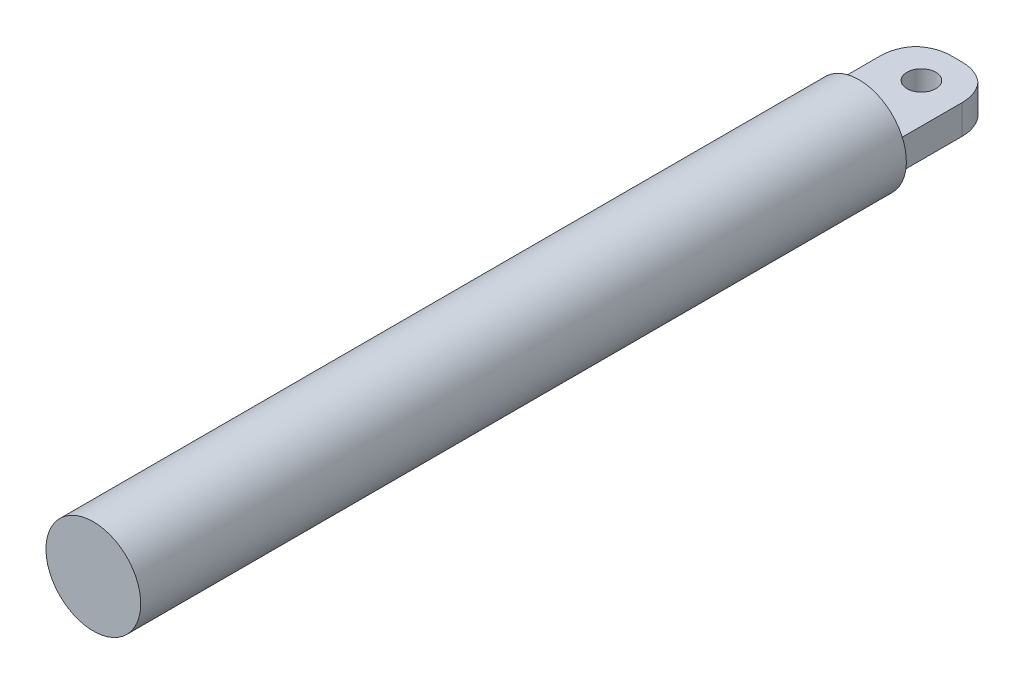
ISO-10303-21;
HEADER;
FILE_DESCRIPTION(('STEP AP214'),'2;1');
FILE_NAME('part.step','',(''),(''),'','','');
FILE_SCHEMA(('AUTOMOTIVE_DESIGN { 1 0 10303 214 1 1 1 1 }'));
ENDSEC;
DATA;
#1=APPLICATION_CONTEXT('core data for automotive mechanical design processes');
#2=APPLICATION_PROTOCOL_DEFINITION('international standard','automotive_design',2000,#1);
#3=PRODUCT_CONTEXT('',#1,'mechanical');
#4=PRODUCT('Part','Part','',(#3));
#5=PRODUCT_RELATED_PRODUCT_CATEGORY('part','',(#4));
#6=PRODUCT_DEFINITION_FORMATION('','',#4);
#7=PRODUCT_DEFINITION_CONTEXT('part definition',#1,'design');
#8=PRODUCT_DEFINITION('design','',#6,#7);
#9=PRODUCT_DEFINITION_SHAPE('','',#8);
#10=(LENGTH_UNIT() NAMED_UNIT(*) SI_UNIT(.MILLI.,.METRE.));
#11=(NAMED_UNIT(*) PLANE_ANGLE_UNIT() SI_UNIT($,.RADIAN.));
#12=(NAMED_UNIT(*) SI_UNIT($,.STERADIAN.) SOLID_ANGLE_UNIT());
#13=UNCERTAINTY_MEASURE_WITH_UNIT(LENGTH_MEASURE(1.E-05),#10,'distance_accuracy_value','');
#14=(GEOMETRIC_REPRESENTATION_CONTEXT(3) GLOBAL_UNCERTAINTY_ASSIGNED_CONTEXT((#13)) GLOBAL_UNIT_ASSIGNED_CONTEXT((#10,
#11,#12)) REPRESENTATION_CONTEXT('',''));
#15=CARTESIAN_POINT('',(0.,0.,0.));
#16=DIRECTION('',(0.,0.,1.));
#17=DIRECTION('',(1.,0.,0.));
#18=AXIS2_PLACEMENT_3D('',#15,#16,#17);
#19=CARTESIAN_POINT('',(-0.111192844127526,-2.71905444652675,760.069910861368));
#20=DIRECTION('',(0.,0.,1.));
#21=DIRECTION('',(0.,-1.,0.));
#22=AXIS2_PLACEMENT_3D('',#19,#20,#21);
#23=PLANE('',#22);
#24=CARTESIAN_POINT('',(-0.111192844127526,-2.71905444652675,760.069910861368));
#25=DIRECTION('',(0.,0.,-1.));
#26=DIRECTION('',(0.,1.,0.));
#27=AXIS2_PLACEMENT_3D('',#24,#25,#26);
#28=CIRCLE('',#27,90.7335);
#29=CARTESIAN_POINT('',(-0.111192844127526,88.0144455534732,760.069910861368));
#30=VERTEX_POINT('',#29);
#31=EDGE_CURVE('E144',#30,#30,#28,.T.);
#32=ORIENTED_EDGE('',*,*,#31,.F.);
#33=EDGE_LOOP('',(#32));
#34=FACE_BOUND('',#33,.T.);
#35=ADVANCED_FACE('F40',(#34),#23,.T.);
#36=CARTESIAN_POINT('',(-0.111192844127526,-2.71905444652658,-706.330089138632));
#37=DIRECTION('',(0.,0.,-1.));
#38=DIRECTION('',(0.,1.,0.));
#39=AXIS2_PLACEMENT_3D('',#36,#37,#38);
#40=PLANE('',#39);
#41=DIRECTION('',(0.,-1.,0.));
#42=VECTOR('',#41,1.);
#43=CARTESIAN_POINT('',(81.401830968793,-2.71905444652658,-706.330089138632));
#44=LINE('',#43,#42);
#45=CARTESIAN_POINT('',(81.401830968793,32.729832945527,-706.330089138632));
#46=VERTEX_POINT('',#45);
#47=CARTESIAN_POINT('',(81.401830968793,-23.3268138108288,-706.330089138632));
#48=VERTEX_POINT('',#47);
#49=EDGE_CURVE('E113',#46,#48,#44,.T.);
#50=ORIENTED_EDGE('',*,*,#49,.F.);
#51=DIRECTION('',(1.,0.,0.));
#52=VECTOR('',#51,1.);
#53=CARTESIAN_POINT('',(-0.111192844127526,32.729832945527,-706.330089138632));
#54=LINE('',#53,#52);
#55=CARTESIAN_POINT('',(-74.4330263147913,32.729832945527,-706.330089138632));
#56=VERTEX_POINT('',#55);
#57=EDGE_CURVE('E127',#56,#46,#54,.T.);
#58=ORIENTED_EDGE('',*,*,#57,.F.);
#59=DIRECTION('',(0.,1.,0.));
#60=VECTOR('',#59,1.);
#61=CARTESIAN_POINT('',(-74.4330263147913,-2.71905444652658,-706.330089138632));
#62=LINE('',#61,#60);
#63=CARTESIAN_POINT('',(-74.4330263147913,-23.3268138108288,-706.330089138632));
#64=VERTEX_POINT('',#63);
#65=EDGE_CURVE('E137',#64,#56,#62,.T.);
#66=ORIENTED_EDGE('',*,*,#65,.F.);
#67=DIRECTION('',(-1.,0.,0.));
#68=VECTOR('',#67,1.);
#69=CARTESIAN_POINT('',(-0.111192844127526,-23.3268138108288,-706.330089138632));
#70=LINE('',#69,#68);
#71=EDGE_CURVE('E130',#48,#64,#70,.T.);
#72=ORIENTED_EDGE('',*,*,#71,.F.);
#73=EDGE_LOOP('',(#50,#58,#66,#72));
#74=FACE_BOUND('',#73,.T.);
#75=CARTESIAN_POINT('',(-0.111192844127526,-2.71905444652658,-706.330089138632));
#76=DIRECTION('',(0.,0.,-1.));
#77=DIRECTION('',(0.,1.,0.));
#78=AXIS2_PLACEMENT_3D('',#75,#76,#77);
#79=CIRCLE('',#78,90.7335);
#80=CARTESIAN_POINT('',(-0.111192844127526,88.0144455534734,-706.330089138632));
#81=VERTEX_POINT('',#80);
#82=EDGE_CURVE('E138',#81,#81,#79,.T.);
#83=ORIENTED_EDGE('',*,*,#82,.T.);
#84=EDGE_LOOP('',(#83));
#85=FACE_BOUND('',#84,.T.);
#86=ADVANCED_FACE('F124',(#74,#85),#40,.T.);
#87=CARTESIAN_POINT('',(-0.111192844127526,-2.71905444652658,-706.330089138632));
#88=DIRECTION('',(0.,0.,-1.));
#89=DIRECTION('',(0.,1.,0.));
#90=AXIS2_PLACEMENT_3D('',#87,#88,#89);
#91=CYLINDRICAL_SURFACE('',#90,90.7335);
#92=ORIENTED_EDGE('',*,*,#31,.T.);
#93=EDGE_LOOP('',(#92));
#94=FACE_BOUND('',#93,.T.);
#95=ORIENTED_EDGE('',*,*,#82,.F.);
#96=EDGE_LOOP('',(#95));
#97=FACE_BOUND('',#96,.T.);
#98=ADVANCED_FACE('F216',(#94,#97),#91,.T.);
#99=CARTESIAN_POINT('',(81.401830968793,32.729832945527,-889.630089138632));
#100=DIRECTION('',(1.,0.,0.));
#101=DIRECTION('',(0.,0.,-1.));
#102=AXIS2_PLACEMENT_3D('',#99,#100,#101);
#103=PLANE('',#102);
#104=DIRECTION('',(0.,0.,1.));
#105=VECTOR('',#104,1.);
#106=CARTESIAN_POINT('',(81.401830968793,-23.3268138108288,-889.630089138632));
#107=LINE('',#106,#105);
#108=CARTESIAN_POINT('',(81.401830968793,-23.3268138108288,-822.599950745437));
#109=VERTEX_POINT('',#108);
#110=EDGE_CURVE('E205',#109,#48,#107,.T.);
#111=ORIENTED_EDGE('',*,*,#110,.F.);
#112=DIRECTION('',(0.,-1.,0.));
#113=VECTOR('',#112,1.);
#114=CARTESIAN_POINT('',(81.401830968793,32.729832945527,-822.599950745437));
#115=LINE('',#114,#113);
#116=CARTESIAN_POINT('',(81.401830968793,32.729832945527,-822.599950745437));
#117=VERTEX_POINT('',#116);
#118=EDGE_CURVE('E50',#109,#117,#115,.F.);
#119=ORIENTED_EDGE('',*,*,#118,.T.);
#120=DIRECTION('',(0.,0.,1.));
#121=VECTOR('',#120,1.);
#122=CARTESIAN_POINT('',(81.401830968793,32.729832945527,-889.630089138632));
#123=LINE('',#122,#121);
#124=EDGE_CURVE('E109',#117,#46,#123,.T.);
#125=ORIENTED_EDGE('',*,*,#124,.T.);
#126=ORIENTED_EDGE('',*,*,#49,.T.);
#127=EDGE_LOOP('',(#111,#119,#125,#126));
#128=FACE_BOUND('',#127,.T.);
#129=ADVANCED_FACE('F112',(#128),#103,.T.);
#130=CARTESIAN_POINT('',(81.401830968793,-23.3268138108288,-889.630089138632));
#131=DIRECTION('',(0.,-1.,0.));
#132=DIRECTION('',(0.,0.,-1.));
#133=AXIS2_PLACEMENT_3D('',#130,#131,#132);
#134=PLANE('',#133);
#135=CARTESIAN_POINT('',(5.68910131256064,-23.3268138108288,-820.086722731454));
#136=DIRECTION('',(0.,-1.,0.));
#137=DIRECTION('',(0.,0.,-1.));
#138=AXIS2_PLACEMENT_3D('',#135,#136,#137);
#139=CIRCLE('',#138,27.495);
#140=CARTESIAN_POINT('',(5.68910131256064,-23.3268138108288,-847.581722731454));
#141=VERTEX_POINT('',#140);
#142=EDGE_CURVE('E190',#141,#141,#139,.T.);
#143=ORIENTED_EDGE('',*,*,#142,.F.);
#144=EDGE_LOOP('',(#143));
#145=FACE_BOUND('',#144,.T.);
#146=CARTESIAN_POINT('',(14.3716925755976,-23.3268138108288,-816.310089138632));
#147=DIRECTION('',(0.,-1.,0.));
#148=DIRECTION('',(0.,0.,-1.));
#149=AXIS2_PLACEMENT_3D('',#146,#147,#148);
#150=CIRCLE('',#149,73.32);
#151=CARTESIAN_POINT('',(14.3716925755976,-23.3268138108288,-889.630089138632));
#152=VERTEX_POINT('',#151);
#153=CARTESIAN_POINT('',(62.9763570386491,-23.3268138108288,-871.204615208489));
#154=VERTEX_POINT('',#153);
#155=EDGE_CURVE('E58',#152,#154,#150,.T.);
#156=ORIENTED_EDGE('',*,*,#155,.T.);
#157=CARTESIAN_POINT('',(8.08183096879297,-23.3268138108288,-822.599950745437));
#158=DIRECTION('',(0.,-1.,0.));
#159=DIRECTION('',(0.,0.,-1.));
#160=AXIS2_PLACEMENT_3D('',#157,#158,#159);
#161=CIRCLE('',#160,73.32);
#162=EDGE_CURVE('E175',#154,#109,#161,.T.);
#163=ORIENTED_EDGE('',*,*,#162,.T.);
#164=ORIENTED_EDGE('',*,*,#110,.T.);
#165=ORIENTED_EDGE('',*,*,#71,.T.);
#166=DIRECTION('',(0.,0.,1.));
#167=VECTOR('',#166,1.);
#168=CARTESIAN_POINT('',(-74.4330263147913,-23.3268138108288,-889.630089138632));
#169=LINE('',#168,#167);
#170=CARTESIAN_POINT('',(-74.4330263147913,-23.3268138108288,-822.599950745437));
#171=VERTEX_POINT('',#170);
#172=EDGE_CURVE('E208',#171,#64,#169,.T.);
#173=ORIENTED_EDGE('',*,*,#172,.F.);
#174=CARTESIAN_POINT('',(-1.11302631479126,-23.3268138108288,-822.599950745437));
#175=DIRECTION('',(0.,-1.,0.));
#176=DIRECTION('',(0.,0.,-1.));
#177=AXIS2_PLACEMENT_3D('',#174,#175,#176);
#178=CIRCLE('',#177,73.32);
#179=CARTESIAN_POINT('',(-56.0075523846473,-23.3268138108288,-871.204615208489));
#180=VERTEX_POINT('',#179);
#181=EDGE_CURVE('E65',#171,#180,#178,.T.);
#182=ORIENTED_EDGE('',*,*,#181,.T.);
#183=CARTESIAN_POINT('',(-7.40288792159584,-23.3268138108288,-816.310089138632));
#184=DIRECTION('',(0.,-1.,0.));
#185=DIRECTION('',(0.,0.,-1.));
#186=AXIS2_PLACEMENT_3D('',#183,#184,#185);
#187=CIRCLE('',#186,73.32);
#188=CARTESIAN_POINT('',(-7.40288792159584,-23.3268138108288,-889.630089138632));
#189=VERTEX_POINT('',#188);
#190=EDGE_CURVE('E170',#180,#189,#187,.T.);
#191=ORIENTED_EDGE('',*,*,#190,.T.);
#192=DIRECTION('',(1.,0.,0.));
#193=VECTOR('',#192,1.);
#194=CARTESIAN_POINT('',(81.401830968793,-23.3268138108288,-889.630089138632));
#195=LINE('',#194,#193);
#196=EDGE_CURVE('E119',#189,#152,#195,.T.);
#197=ORIENTED_EDGE('',*,*,#196,.T.);
#198=EDGE_LOOP('',(#156,#163,#164,#165,#173,#182,#191,#197));
#199=FACE_BOUND('',#198,.T.);
#200=ADVANCED_FACE('F243',(#145,#199),#134,.T.);
#201=CARTESIAN_POINT('',(-74.4330263147913,32.729832945527,-889.630089138632));
#202=DIRECTION('',(-1.,0.,0.));
#203=DIRECTION('',(0.,0.,1.));
#204=AXIS2_PLACEMENT_3D('',#201,#202,#203);
#205=PLANE('',#204);
#206=DIRECTION('',(0.,0.,1.));
#207=VECTOR('',#206,1.);
#208=CARTESIAN_POINT('',(-74.4330263147913,32.729832945527,-889.630089138632));
#209=LINE('',#208,#207);
#210=CARTESIAN_POINT('',(-74.4330263147913,32.729832945527,-822.599950745437));
#211=VERTEX_POINT('',#210);
#212=EDGE_CURVE('E118',#211,#56,#209,.T.);
#213=ORIENTED_EDGE('',*,*,#212,.F.);
#214=DIRECTION('',(0.,1.,0.));
#215=VECTOR('',#214,1.);
#216=CARTESIAN_POINT('',(-74.4330263147913,32.729832945527,-822.599950745437));
#217=LINE('',#216,#215);
#218=EDGE_CURVE('E11',#211,#171,#217,.F.);
#219=ORIENTED_EDGE('',*,*,#218,.T.);
#220=ORIENTED_EDGE('',*,*,#172,.T.);
#221=ORIENTED_EDGE('',*,*,#65,.T.);
#222=EDGE_LOOP('',(#213,#219,#220,#221));
#223=FACE_BOUND('',#222,.T.);
#224=ADVANCED_FACE('F253',(#223),#205,.T.);
#225=CARTESIAN_POINT('',(81.401830968793,32.729832945527,-889.630089138632));
#226=DIRECTION('',(0.,1.,0.));
#227=DIRECTION('',(0.,0.,1.));
#228=AXIS2_PLACEMENT_3D('',#225,#226,#227);
#229=PLANE('',#228);
#230=CARTESIAN_POINT('',(5.68910131256064,32.729832945527,-820.086722731454));
#231=DIRECTION('',(0.,1.,0.));
#232=DIRECTION('',(0.,0.,1.));
#233=AXIS2_PLACEMENT_3D('',#230,#231,#232);
#234=CIRCLE('',#233,27.495);
#235=CARTESIAN_POINT('',(5.68910131256064,32.729832945527,-792.591722731454));
#236=VERTEX_POINT('',#235);
#237=EDGE_CURVE('E195',#236,#236,#234,.T.);
#238=ORIENTED_EDGE('',*,*,#237,.F.);
#239=EDGE_LOOP('',(#238));
#240=FACE_BOUND('',#239,.T.);
#241=ORIENTED_EDGE('',*,*,#124,.F.);
#242=CARTESIAN_POINT('',(8.08183096879297,32.729832945527,-822.599950745437));
#243=DIRECTION('',(0.,1.,0.));
#244=DIRECTION('',(0.,0.,1.));
#245=AXIS2_PLACEMENT_3D('',#242,#243,#244);
#246=CIRCLE('',#245,73.32);
#247=CARTESIAN_POINT('',(62.9763570386491,32.729832945527,-871.204615208489));
#248=VERTEX_POINT('',#247);
#249=EDGE_CURVE('E165',#117,#248,#246,.T.);
#250=ORIENTED_EDGE('',*,*,#249,.T.);
#251=CARTESIAN_POINT('',(14.3716925755976,32.729832945527,-816.310089138632));
#252=DIRECTION('',(0.,1.,0.));
#253=DIRECTION('',(0.,0.,1.));
#254=AXIS2_PLACEMENT_3D('',#251,#252,#253);
#255=CIRCLE('',#254,73.32);
#256=CARTESIAN_POINT('',(14.3716925755976,32.729832945527,-889.630089138632));
#257=VERTEX_POINT('',#256);
#258=EDGE_CURVE('E162',#248,#257,#255,.T.);
#259=ORIENTED_EDGE('',*,*,#258,.T.);
#260=DIRECTION('',(-1.,0.,0.));
#261=VECTOR('',#260,1.);
#262=CARTESIAN_POINT('',(81.401830968793,32.729832945527,-889.630089138632));
#263=LINE('',#262,#261);
#264=CARTESIAN_POINT('',(-7.40288792159584,32.729832945527,-889.630089138632));
#265=VERTEX_POINT('',#264);
#266=EDGE_CURVE('E182',#257,#265,#263,.T.);
#267=ORIENTED_EDGE('',*,*,#266,.T.);
#268=CARTESIAN_POINT('',(-7.40288792159584,32.729832945527,-816.310089138632));
#269=DIRECTION('',(0.,1.,0.));
#270=DIRECTION('',(0.,0.,1.));
#271=AXIS2_PLACEMENT_3D('',#268,#269,#270);
#272=CIRCLE('',#271,73.32);
#273=CARTESIAN_POINT('',(-56.0075523846473,32.729832945527,-871.204615208489));
#274=VERTEX_POINT('',#273);
#275=EDGE_CURVE('E159',#265,#274,#272,.T.);
#276=ORIENTED_EDGE('',*,*,#275,.T.);
#277=CARTESIAN_POINT('',(-1.11302631479126,32.729832945527,-822.599950745437));
#278=DIRECTION('',(0.,1.,0.));
#279=DIRECTION('',(0.,0.,1.));
#280=AXIS2_PLACEMENT_3D('',#277,#278,#279);
#281=CIRCLE('',#280,73.32);
#282=EDGE_CURVE('E156',#274,#211,#281,.T.);
#283=ORIENTED_EDGE('',*,*,#282,.T.);
#284=ORIENTED_EDGE('',*,*,#212,.T.);
#285=ORIENTED_EDGE('',*,*,#57,.T.);
#286=EDGE_LOOP('',(#241,#250,#259,#267,#276,#283,#284,#285));
#287=FACE_BOUND('',#286,.T.);
#288=ADVANCED_FACE('F134',(#240,#287),#229,.T.);
#289=CARTESIAN_POINT('',(-0.111192844127526,42.6476955534733,-889.630089138632));
#290=DIRECTION('',(0.,0.,-1.));
#291=DIRECTION('',(-1.,0.,0.));
#292=AXIS2_PLACEMENT_3D('',#289,#290,#291);
#293=PLANE('',#292);
#294=ORIENTED_EDGE('',*,*,#196,.F.);
#295=DIRECTION('',(0.,-1.,0.));
#296=VECTOR('',#295,1.);
#297=CARTESIAN_POINT('',(-7.40288792159584,42.6476955534733,-889.630089138632));
#298=LINE('',#297,#296);
#299=EDGE_CURVE('E152',#189,#265,#298,.F.);
#300=ORIENTED_EDGE('',*,*,#299,.T.);
#301=ORIENTED_EDGE('',*,*,#266,.F.);
#302=DIRECTION('',(0.,1.,0.));
#303=VECTOR('',#302,1.);
#304=CARTESIAN_POINT('',(14.3716925755976,42.6476955534733,-889.630089138632));
#305=LINE('',#304,#303);
#306=EDGE_CURVE('E132',#257,#152,#305,.F.);
#307=ORIENTED_EDGE('',*,*,#306,.T.);
#308=EDGE_LOOP('',(#294,#300,#301,#307));
#309=FACE_BOUND('',#308,.T.);
#310=ADVANCED_FACE('F232',(#309),#293,.T.);
#311=CARTESIAN_POINT('',(-1.11302631479126,32.729832945527,-822.599950745437));
#312=DIRECTION('',(0.,1.,0.));
#313=DIRECTION('',(0.,0.,1.));
#314=AXIS2_PLACEMENT_3D('',#311,#312,#313);
#315=CYLINDRICAL_SURFACE('',#314,73.32);
#316=DIRECTION('',(0.,1.,0.));
#317=VECTOR('',#316,1.);
#318=CARTESIAN_POINT('',(-56.0075523846473,4.70150956734906,-871.204615208489));
#319=LINE('',#318,#317);
#320=EDGE_CURVE('E179',#180,#274,#319,.T.);
#321=ORIENTED_EDGE('',*,*,#320,.F.);
#322=ORIENTED_EDGE('',*,*,#181,.F.);
#323=ORIENTED_EDGE('',*,*,#218,.F.);
#324=ORIENTED_EDGE('',*,*,#282,.F.);
#325=EDGE_LOOP('',(#321,#322,#323,#324));
#326=FACE_BOUND('',#325,.T.);
#327=ADVANCED_FACE('F230',(#326),#315,.T.);
#328=CARTESIAN_POINT('',(-7.40288792159584,42.6476955534733,-816.310089138632));
#329=DIRECTION('',(0.,-1.,0.));
#330=DIRECTION('',(0.,0.,-1.));
#331=AXIS2_PLACEMENT_3D('',#328,#329,#330);
#332=CYLINDRICAL_SURFACE('',#331,73.32);
#333=ORIENTED_EDGE('',*,*,#190,.F.);
#334=ORIENTED_EDGE('',*,*,#320,.T.);
#335=ORIENTED_EDGE('',*,*,#275,.F.);
#336=ORIENTED_EDGE('',*,*,#299,.F.);
#337=EDGE_LOOP('',(#333,#334,#335,#336));
#338=FACE_BOUND('',#337,.T.);
#339=ADVANCED_FACE('F227',(#338),#332,.T.);
#340=CARTESIAN_POINT('',(14.3716925755976,42.6476955534733,-816.310089138632));
#341=DIRECTION('',(0.,1.,0.));
#342=DIRECTION('',(0.,0.,1.));
#343=AXIS2_PLACEMENT_3D('',#340,#341,#342);
#344=CYLINDRICAL_SURFACE('',#343,73.32);
#345=DIRECTION('',(0.,1.,0.));
#346=VECTOR('',#345,1.);
#347=CARTESIAN_POINT('',(62.976357038649,4.70150956734906,-871.204615208489));
#348=LINE('',#347,#346);
#349=EDGE_CURVE('E44',#154,#248,#348,.T.);
#350=ORIENTED_EDGE('',*,*,#349,.F.);
#351=ORIENTED_EDGE('',*,*,#155,.F.);
#352=ORIENTED_EDGE('',*,*,#306,.F.);
#353=ORIENTED_EDGE('',*,*,#258,.F.);
#354=EDGE_LOOP('',(#350,#351,#352,#353));
#355=FACE_BOUND('',#354,.T.);
#356=ADVANCED_FACE('F42',(#355),#344,.T.);
#357=CARTESIAN_POINT('',(8.08183096879297,32.729832945527,-822.599950745437));
#358=DIRECTION('',(0.,-1.,0.));
#359=DIRECTION('',(0.,0.,-1.));
#360=AXIS2_PLACEMENT_3D('',#357,#358,#359);
#361=CYLINDRICAL_SURFACE('',#360,73.32);
#362=ORIENTED_EDGE('',*,*,#162,.F.);
#363=ORIENTED_EDGE('',*,*,#349,.T.);
#364=ORIENTED_EDGE('',*,*,#249,.F.);
#365=ORIENTED_EDGE('',*,*,#118,.F.);
#366=EDGE_LOOP('',(#362,#363,#364,#365));
#367=FACE_BOUND('',#366,.T.);
#368=ADVANCED_FACE('F234',(#367),#361,.T.);
#369=CARTESIAN_POINT('',(5.68910131256064,-40.5901670544731,-820.086722731454));
#370=DIRECTION('',(0.,1.,0.));
#371=DIRECTION('',(0.,0.,1.));
#372=AXIS2_PLACEMENT_3D('',#369,#370,#371);
#373=CYLINDRICAL_SURFACE('',#372,27.495);
#374=ORIENTED_EDGE('',*,*,#142,.T.);
#375=EDGE_LOOP('',(#374));
#376=FACE_BOUND('',#375,.T.);
#377=ORIENTED_EDGE('',*,*,#237,.T.);
#378=EDGE_LOOP('',(#377));
#379=FACE_BOUND('',#378,.T.);
#380=ADVANCED_FACE('F236',(#376,#379),#373,.F.);
#381=CLOSED_SHELL('',(#35,#86,#98,#129,#200,#224,#288,#310,#327,#339,#356,#368,#380));
#382=MANIFOLD_SOLID_BREP('B2',#381);
#383=ADVANCED_BREP_SHAPE_REPRESENTATION('',(#18,#382),#14);
#384=SHAPE_DEFINITION_REPRESENTATION(#9,#383);
ENDSEC;
END-ISO-10303-21;
